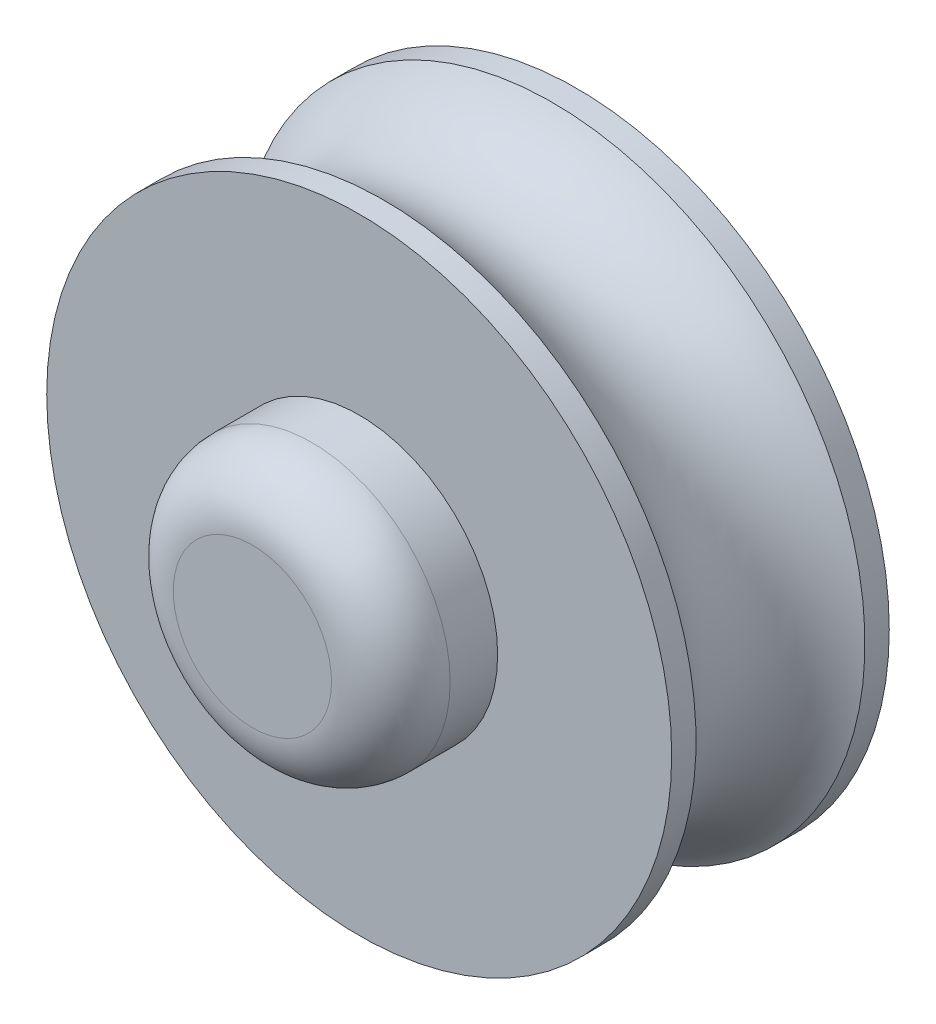
ISO-10303-21;
HEADER;
FILE_DESCRIPTION(('STEP AP214'),'2;1');
FILE_NAME('part.step','',(''),(''),'','','');
FILE_SCHEMA(('AUTOMOTIVE_DESIGN { 1 0 10303 214 1 1 1 1 }'));
ENDSEC;
DATA;
#1=APPLICATION_CONTEXT('core data for automotive mechanical design processes');
#2=APPLICATION_PROTOCOL_DEFINITION('international standard','automotive_design',2000,#1);
#3=PRODUCT_CONTEXT('',#1,'mechanical');
#4=PRODUCT('Part','Part','',(#3));
#5=PRODUCT_RELATED_PRODUCT_CATEGORY('part','',(#4));
#6=PRODUCT_DEFINITION_FORMATION('','',#4);
#7=PRODUCT_DEFINITION_CONTEXT('part definition',#1,'design');
#8=PRODUCT_DEFINITION('design','',#6,#7);
#9=PRODUCT_DEFINITION_SHAPE('','',#8);
#10=(LENGTH_UNIT() NAMED_UNIT(*) SI_UNIT(.MILLI.,.METRE.));
#11=(NAMED_UNIT(*) PLANE_ANGLE_UNIT() SI_UNIT($,.RADIAN.));
#12=(NAMED_UNIT(*) SI_UNIT($,.STERADIAN.) SOLID_ANGLE_UNIT());
#13=UNCERTAINTY_MEASURE_WITH_UNIT(LENGTH_MEASURE(1.E-05),#10,'distance_accuracy_value','');
#14=(GEOMETRIC_REPRESENTATION_CONTEXT(3) GLOBAL_UNCERTAINTY_ASSIGNED_CONTEXT((#13)) GLOBAL_UNIT_ASSIGNED_CONTEXT((#10,
#11,#12)) REPRESENTATION_CONTEXT('',''));
#15=CARTESIAN_POINT('',(0.,0.,0.));
#16=DIRECTION('',(0.,0.,1.));
#17=DIRECTION('',(1.,0.,0.));
#18=AXIS2_PLACEMENT_3D('',#15,#16,#17);
#19=CARTESIAN_POINT('',(0.,0.,5.5));
#20=DIRECTION('',(0.,0.,-1.));
#21=DIRECTION('',(-1.,0.,0.));
#22=AXIS2_PLACEMENT_3D('',#19,#20,#21);
#23=CYLINDRICAL_SURFACE('',#22,7.9);
#24=CARTESIAN_POINT('',(0.,0.,0.614999999999997));
#25=DIRECTION('',(0.,0.,-1.));
#26=DIRECTION('',(-1.,0.,0.));
#27=AXIS2_PLACEMENT_3D('',#24,#25,#26);
#28=CIRCLE('',#27,7.9);
#29=CARTESIAN_POINT('',(-7.9,0.,0.614999999999997));
#30=VERTEX_POINT('',#29);
#31=EDGE_CURVE('E74',#30,#30,#28,.T.);
#32=ORIENTED_EDGE('',*,*,#31,.T.);
#33=EDGE_LOOP('',(#32));
#34=FACE_BOUND('',#33,.T.);
#35=CARTESIAN_POINT('',(0.,0.,0.));
#36=DIRECTION('',(0.,0.,1.));
#37=DIRECTION('',(1.,0.,0.));
#38=AXIS2_PLACEMENT_3D('',#35,#36,#37);
#39=CIRCLE('',#38,7.9);
#40=CARTESIAN_POINT('',(7.9,0.,0.));
#41=VERTEX_POINT('',#40);
#42=EDGE_CURVE('E86',#41,#41,#39,.T.);
#43=ORIENTED_EDGE('',*,*,#42,.T.);
#44=EDGE_LOOP('',(#43));
#45=FACE_BOUND('',#44,.T.);
#46=ADVANCED_FACE('F33',(#34,#45),#23,.T.);
#47=CARTESIAN_POINT('',(0.,0.,0.));
#48=DIRECTION('',(0.,0.,1.));
#49=DIRECTION('',(1.,0.,0.));
#50=AXIS2_PLACEMENT_3D('',#47,#48,#49);
#51=CONICAL_SURFACE('',#50,7.9,1.28281700021584);
#52=CARTESIAN_POINT('',(0.,0.,-1.30333937783314));
#53=DIRECTION('',(0.,0.,1.));
#54=DIRECTION('',(1.,0.,0.));
#55=AXIS2_PLACEMENT_3D('',#52,#53,#54);
#56=CIRCLE('',#55,3.5);
#57=CARTESIAN_POINT('',(3.5,0.,-1.30333937783314));
#58=VERTEX_POINT('',#57);
#59=EDGE_CURVE('E64',#58,#58,#56,.T.);
#60=ORIENTED_EDGE('',*,*,#59,.T.);
#61=EDGE_LOOP('',(#60));
#62=FACE_BOUND('',#61,.T.);
#63=ORIENTED_EDGE('',*,*,#42,.F.);
#64=EDGE_LOOP('',(#63));
#65=FACE_BOUND('',#64,.T.);
#66=ADVANCED_FACE('F113',(#62,#65),#51,.T.);
#67=CARTESIAN_POINT('',(0.,-3.5,-1.30333937783314));
#68=DIRECTION('',(0.,0.,-1.));
#69=DIRECTION('',(-1.,0.,0.));
#70=AXIS2_PLACEMENT_3D('',#67,#68,#69);
#71=PLANE('',#70);
#72=DIRECTION('',(0.,-1.,0.));
#73=VECTOR('',#72,1.);
#74=CARTESIAN_POINT('',(1.02,0.,-1.30333937783314));
#75=LINE('',#74,#73);
#76=CARTESIAN_POINT('',(1.02,1.2327205684988,-1.30333937783314));
#77=VERTEX_POINT('',#76);
#78=CARTESIAN_POINT('',(1.02,-1.2327205684988,-1.30333937783314));
#79=VERTEX_POINT('',#78);
#80=EDGE_CURVE('E48',#77,#79,#75,.T.);
#81=ORIENTED_EDGE('',*,*,#80,.F.);
#82=CARTESIAN_POINT('',(0.,0.,-1.30333937783314));
#83=DIRECTION('',(0.,0.,-1.));
#84=DIRECTION('',(-1.,0.,0.));
#85=AXIS2_PLACEMENT_3D('',#82,#83,#84);
#86=CIRCLE('',#85,1.6);
#87=EDGE_CURVE('E68',#79,#77,#86,.T.);
#88=ORIENTED_EDGE('',*,*,#87,.F.);
#89=EDGE_LOOP('',(#81,#88));
#90=FACE_BOUND('',#89,.T.);
#91=ORIENTED_EDGE('',*,*,#59,.F.);
#92=EDGE_LOOP('',(#91));
#93=FACE_BOUND('',#92,.T.);
#94=ADVANCED_FACE('F72',(#90,#93),#71,.T.);
#95=CARTESIAN_POINT('',(1.02,0.,7.99666062216686));
#96=DIRECTION('',(1.,0.,0.));
#97=DIRECTION('',(0.,1.,0.));
#98=AXIS2_PLACEMENT_3D('',#95,#96,#97);
#99=PLANE('',#98);
#100=ORIENTED_EDGE('',*,*,#80,.T.);
#101=DIRECTION('',(0.,0.,-1.));
#102=VECTOR('',#101,1.);
#103=CARTESIAN_POINT('',(1.02,-1.2327205684988,7.99666062216686));
#104=LINE('',#103,#102);
#105=CARTESIAN_POINT('',(1.02,-1.2327205684988,7.99666062216686));
#106=VERTEX_POINT('',#105);
#107=EDGE_CURVE('E65',#106,#79,#104,.T.);
#108=ORIENTED_EDGE('',*,*,#107,.F.);
#109=DIRECTION('',(0.,-1.,0.));
#110=VECTOR('',#109,1.);
#111=CARTESIAN_POINT('',(1.02,0.,7.99666062216686));
#112=LINE('',#111,#110);
#113=CARTESIAN_POINT('',(1.02,1.2327205684988,7.99666062216686));
#114=VERTEX_POINT('',#113);
#115=EDGE_CURVE('E62',#114,#106,#112,.T.);
#116=ORIENTED_EDGE('',*,*,#115,.F.);
#117=DIRECTION('',(0.,0.,-1.));
#118=VECTOR('',#117,1.);
#119=CARTESIAN_POINT('',(1.02,1.2327205684988,7.99666062216686));
#120=LINE('',#119,#118);
#121=EDGE_CURVE('E56',#114,#77,#120,.T.);
#122=ORIENTED_EDGE('',*,*,#121,.T.);
#123=EDGE_LOOP('',(#100,#108,#116,#122));
#124=FACE_BOUND('',#123,.T.);
#125=ADVANCED_FACE('F60',(#124),#99,.F.);
#126=CARTESIAN_POINT('',(0.,0.,7.99666062216686));
#127=DIRECTION('',(0.,0.,-1.));
#128=DIRECTION('',(-1.,0.,0.));
#129=AXIS2_PLACEMENT_3D('',#126,#127,#128);
#130=CYLINDRICAL_SURFACE('',#129,1.6);
#131=ORIENTED_EDGE('',*,*,#87,.T.);
#132=ORIENTED_EDGE('',*,*,#121,.F.);
#133=CARTESIAN_POINT('',(0.,0.,7.99666062216686));
#134=DIRECTION('',(0.,0.,-1.));
#135=DIRECTION('',(-1.,0.,0.));
#136=AXIS2_PLACEMENT_3D('',#133,#134,#135);
#137=CIRCLE('',#136,1.6);
#138=EDGE_CURVE('E80',#106,#114,#137,.T.);
#139=ORIENTED_EDGE('',*,*,#138,.F.);
#140=ORIENTED_EDGE('',*,*,#107,.T.);
#141=EDGE_LOOP('',(#131,#132,#139,#140));
#142=FACE_BOUND('',#141,.T.);
#143=ADVANCED_FACE('F69',(#142),#130,.F.);
#144=CARTESIAN_POINT('',(0.,0.,7.99666062216686));
#145=DIRECTION('',(0.,0.,-1.));
#146=DIRECTION('',(-1.,0.,0.));
#147=AXIS2_PLACEMENT_3D('',#144,#145,#146);
#148=PLANE('',#147);
#149=ORIENTED_EDGE('',*,*,#115,.T.);
#150=ORIENTED_EDGE('',*,*,#138,.T.);
#151=EDGE_LOOP('',(#149,#150));
#152=FACE_BOUND('',#151,.T.);
#153=ADVANCED_FACE('F137',(#152),#148,.T.);
#154=CARTESIAN_POINT('',(0.,0.,2.75));
#155=DIRECTION('',(0.,0.,-1.));
#156=DIRECTION('',(-1.,0.,0.));
#157=AXIS2_PLACEMENT_3D('',#154,#155,#156);
#158=TOROIDAL_SURFACE('',#157,9.20068251314454,2.5);
#159=ORIENTED_EDGE('',*,*,#31,.F.);
#160=EDGE_LOOP('',(#159));
#161=FACE_BOUND('',#160,.T.);
#162=CARTESIAN_POINT('',(0.,0.,4.885));
#163=DIRECTION('',(0.,0.,-1.));
#164=DIRECTION('',(-1.,0.,0.));
#165=AXIS2_PLACEMENT_3D('',#162,#163,#164);
#166=CIRCLE('',#165,7.9);
#167=CARTESIAN_POINT('',(-7.9,0.,4.885));
#168=VERTEX_POINT('',#167);
#169=EDGE_CURVE('E77',#168,#168,#166,.T.);
#170=ORIENTED_EDGE('',*,*,#169,.T.);
#171=EDGE_LOOP('',(#170));
#172=FACE_BOUND('',#171,.T.);
#173=ADVANCED_FACE('F109',(#161,#172),#158,.F.);
#174=CARTESIAN_POINT('',(0.,0.,8.2));
#175=DIRECTION('',(0.,0.,1.));
#176=DIRECTION('',(1.,0.,0.));
#177=AXIS2_PLACEMENT_3D('',#174,#175,#176);
#178=PLANE('',#177);
#179=CARTESIAN_POINT('',(0.,0.,8.2));
#180=DIRECTION('',(0.,0.,1.));
#181=DIRECTION('',(1.,0.,0.));
#182=AXIS2_PLACEMENT_3D('',#179,#180,#181);
#183=CIRCLE('',#182,2.);
#184=CARTESIAN_POINT('',(2.,0.,8.2));
#185=VERTEX_POINT('',#184);
#186=EDGE_CURVE('E41',#185,#185,#183,.T.);
#187=ORIENTED_EDGE('',*,*,#186,.T.);
#188=EDGE_LOOP('',(#187));
#189=FACE_BOUND('',#188,.T.);
#190=ADVANCED_FACE('F97',(#189),#178,.T.);
#191=CARTESIAN_POINT('',(0.,0.,6.7));
#192=DIRECTION('',(0.,0.,1.));
#193=DIRECTION('',(1.,0.,0.));
#194=AXIS2_PLACEMENT_3D('',#191,#192,#193);
#195=TOROIDAL_SURFACE('',#194,2.,1.5);
#196=CARTESIAN_POINT('',(0.,0.,6.7));
#197=DIRECTION('',(0.,0.,1.));
#198=DIRECTION('',(1.,0.,0.));
#199=AXIS2_PLACEMENT_3D('',#196,#197,#198);
#200=CIRCLE('',#199,3.5);
#201=CARTESIAN_POINT('',(3.5,0.,6.7));
#202=VERTEX_POINT('',#201);
#203=EDGE_CURVE('E11',#202,#202,#200,.F.);
#204=ORIENTED_EDGE('',*,*,#203,.F.);
#205=EDGE_LOOP('',(#204));
#206=FACE_BOUND('',#205,.T.);
#207=ORIENTED_EDGE('',*,*,#186,.F.);
#208=EDGE_LOOP('',(#207));
#209=FACE_BOUND('',#208,.T.);
#210=ADVANCED_FACE('F35',(#206,#209),#195,.T.);
#211=CARTESIAN_POINT('',(0.,0.,8.2));
#212=DIRECTION('',(0.,0.,-1.));
#213=DIRECTION('',(-1.,0.,0.));
#214=AXIS2_PLACEMENT_3D('',#211,#212,#213);
#215=CYLINDRICAL_SURFACE('',#214,3.5);
#216=ORIENTED_EDGE('',*,*,#203,.T.);
#217=EDGE_LOOP('',(#216));
#218=FACE_BOUND('',#217,.T.);
#219=CARTESIAN_POINT('',(0.,0.,5.5));
#220=DIRECTION('',(0.,0.,1.));
#221=DIRECTION('',(1.,0.,0.));
#222=AXIS2_PLACEMENT_3D('',#219,#220,#221);
#223=CIRCLE('',#222,3.5);
#224=CARTESIAN_POINT('',(3.5,0.,5.5));
#225=VERTEX_POINT('',#224);
#226=EDGE_CURVE('E90',#225,#225,#223,.T.);
#227=ORIENTED_EDGE('',*,*,#226,.T.);
#228=EDGE_LOOP('',(#227));
#229=FACE_BOUND('',#228,.T.);
#230=ADVANCED_FACE('F100',(#218,#229),#215,.T.);
#231=CARTESIAN_POINT('',(0.,0.,5.5));
#232=DIRECTION('',(0.,0.,1.));
#233=DIRECTION('',(1.,0.,0.));
#234=AXIS2_PLACEMENT_3D('',#231,#232,#233);
#235=PLANE('',#234);
#236=ORIENTED_EDGE('',*,*,#226,.F.);
#237=EDGE_LOOP('',(#236));
#238=FACE_BOUND('',#237,.T.);
#239=CARTESIAN_POINT('',(0.,0.,5.5));
#240=DIRECTION('',(0.,0.,1.));
#241=DIRECTION('',(1.,0.,0.));
#242=AXIS2_PLACEMENT_3D('',#239,#240,#241);
#243=CIRCLE('',#242,7.9);
#244=CARTESIAN_POINT('',(7.9,0.,5.5));
#245=VERTEX_POINT('',#244);
#246=EDGE_CURVE('E89',#245,#245,#243,.T.);
#247=ORIENTED_EDGE('',*,*,#246,.T.);
#248=EDGE_LOOP('',(#247));
#249=FACE_BOUND('',#248,.T.);
#250=ADVANCED_FACE('F106',(#238,#249),#235,.T.);
#251=ORIENTED_EDGE('',*,*,#169,.F.);
#252=EDGE_LOOP('',(#251));
#253=FACE_BOUND('',#252,.T.);
#254=ORIENTED_EDGE('',*,*,#246,.F.);
#255=EDGE_LOOP('',(#254));
#256=FACE_BOUND('',#255,.T.);
#257=ADVANCED_FACE('F115',(#253,#256),#23,.T.);
#258=CLOSED_SHELL('',(#46,#66,#94,#125,#143,#153,#173,#190,#210,#230,#250,#257));
#259=MANIFOLD_SOLID_BREP('B2',#258);
#260=ADVANCED_BREP_SHAPE_REPRESENTATION('',(#18,#259),#14);
#261=SHAPE_DEFINITION_REPRESENTATION(#9,#260);
ENDSEC;
END-ISO-10303-21;
